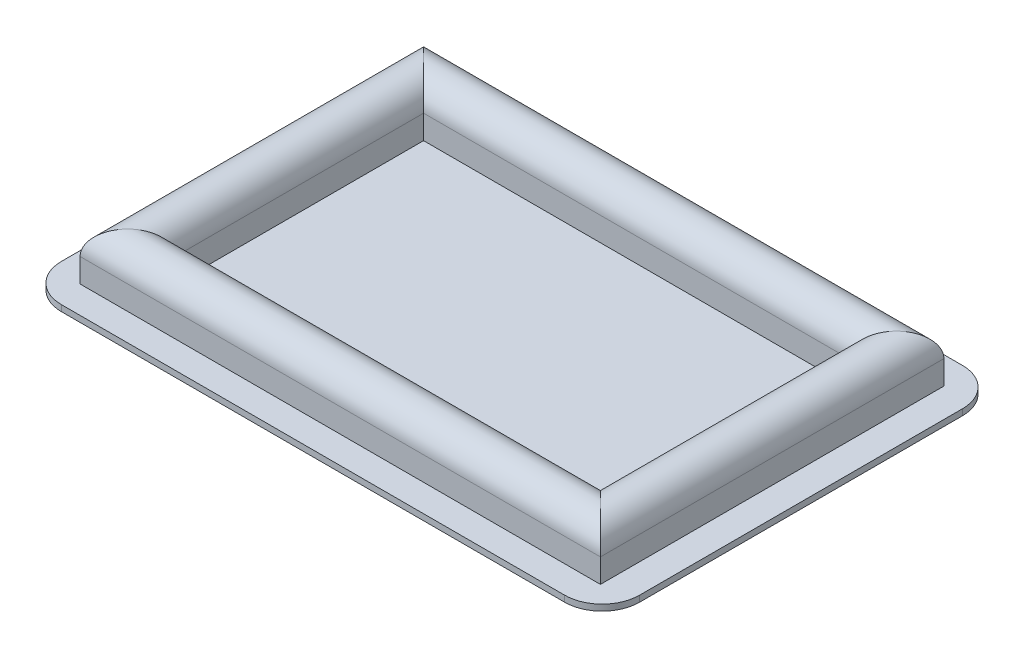
ISO-10303-21;
HEADER;
FILE_DESCRIPTION(('STEP AP214'),'2;1');
FILE_NAME('part.step','',(''),(''),'','','');
FILE_SCHEMA(('AUTOMOTIVE_DESIGN { 1 0 10303 214 1 1 1 1 }'));
ENDSEC;
DATA;
#1=APPLICATION_CONTEXT('core data for automotive mechanical design processes');
#2=APPLICATION_PROTOCOL_DEFINITION('international standard','automotive_design',2000,#1);
#3=PRODUCT_CONTEXT('',#1,'mechanical');
#4=PRODUCT('Part','Part','',(#3));
#5=PRODUCT_RELATED_PRODUCT_CATEGORY('part','',(#4));
#6=PRODUCT_DEFINITION_FORMATION('','',#4);
#7=PRODUCT_DEFINITION_CONTEXT('part definition',#1,'design');
#8=PRODUCT_DEFINITION('design','',#6,#7);
#9=PRODUCT_DEFINITION_SHAPE('','',#8);
#10=(LENGTH_UNIT() NAMED_UNIT(*) SI_UNIT(.MILLI.,.METRE.));
#11=(NAMED_UNIT(*) PLANE_ANGLE_UNIT() SI_UNIT($,.RADIAN.));
#12=(NAMED_UNIT(*) SI_UNIT($,.STERADIAN.) SOLID_ANGLE_UNIT());
#13=UNCERTAINTY_MEASURE_WITH_UNIT(LENGTH_MEASURE(1.E-05),#10,'distance_accuracy_value','');
#14=(GEOMETRIC_REPRESENTATION_CONTEXT(3) GLOBAL_UNCERTAINTY_ASSIGNED_CONTEXT((#13)) GLOBAL_UNIT_ASSIGNED_CONTEXT((#10,
#11,#12)) REPRESENTATION_CONTEXT('',''));
#15=CARTESIAN_POINT('',(0.,0.,0.));
#16=DIRECTION('',(0.,0.,1.));
#17=DIRECTION('',(1.,0.,0.));
#18=AXIS2_PLACEMENT_3D('',#15,#16,#17);
#19=CARTESIAN_POINT('',(-37.,0.9,23.75));
#20=DIRECTION('',(0.,-1.,0.));
#21=DIRECTION('',(0.,0.,-1.));
#22=AXIS2_PLACEMENT_3D('',#19,#20,#21);
#23=PLANE('',#22);
#24=CARTESIAN_POINT('',(-37.,0.9,23.75));
#25=DIRECTION('',(0.,1.,0.));
#26=DIRECTION('',(0.,0.,-1.));
#27=AXIS2_PLACEMENT_3D('',#24,#25,#26);
#28=CIRCLE('',#27,5.5);
#29=CARTESIAN_POINT('',(-42.5,0.9,23.75));
#30=VERTEX_POINT('',#29);
#31=CARTESIAN_POINT('',(-37.,0.9,29.25));
#32=VERTEX_POINT('',#31);
#33=EDGE_CURVE('E226',#30,#32,#28,.T.);
#34=ORIENTED_EDGE('',*,*,#33,.T.);
#35=DIRECTION('',(1.,0.,0.));
#36=VECTOR('',#35,1.);
#37=CARTESIAN_POINT('',(37.,0.9,29.25));
#38=LINE('',#37,#36);
#39=CARTESIAN_POINT('',(37.,0.9,29.25));
#40=VERTEX_POINT('',#39);
#41=EDGE_CURVE('E229',#32,#40,#38,.T.);
#42=ORIENTED_EDGE('',*,*,#41,.T.);
#43=CARTESIAN_POINT('',(37.,0.9,23.75));
#44=DIRECTION('',(0.,1.,0.));
#45=DIRECTION('',(0.,0.,1.));
#46=AXIS2_PLACEMENT_3D('',#43,#44,#45);
#47=CIRCLE('',#46,5.5);
#48=CARTESIAN_POINT('',(42.5,0.9,23.75));
#49=VERTEX_POINT('',#48);
#50=EDGE_CURVE('E232',#40,#49,#47,.T.);
#51=ORIENTED_EDGE('',*,*,#50,.T.);
#52=DIRECTION('',(0.,0.,-1.));
#53=VECTOR('',#52,1.);
#54=CARTESIAN_POINT('',(42.5,0.9,23.75));
#55=LINE('',#54,#53);
#56=CARTESIAN_POINT('',(42.5,0.9,-23.75));
#57=VERTEX_POINT('',#56);
#58=EDGE_CURVE('E234',#49,#57,#55,.T.);
#59=ORIENTED_EDGE('',*,*,#58,.T.);
#60=CARTESIAN_POINT('',(37.,0.9,-23.75));
#61=DIRECTION('',(0.,1.,0.));
#62=DIRECTION('',(0.,0.,1.));
#63=AXIS2_PLACEMENT_3D('',#60,#61,#62);
#64=CIRCLE('',#63,5.5);
#65=CARTESIAN_POINT('',(37.,0.9,-29.25));
#66=VERTEX_POINT('',#65);
#67=EDGE_CURVE('E236',#57,#66,#64,.T.);
#68=ORIENTED_EDGE('',*,*,#67,.T.);
#69=DIRECTION('',(-1.,0.,0.));
#70=VECTOR('',#69,1.);
#71=CARTESIAN_POINT('',(37.,0.9,-29.25));
#72=LINE('',#71,#70);
#73=CARTESIAN_POINT('',(-37.,0.9,-29.25));
#74=VERTEX_POINT('',#73);
#75=EDGE_CURVE('E238',#66,#74,#72,.T.);
#76=ORIENTED_EDGE('',*,*,#75,.T.);
#77=CARTESIAN_POINT('',(-37.,0.9,-23.75));
#78=DIRECTION('',(0.,1.,0.));
#79=DIRECTION('',(0.,0.,1.));
#80=AXIS2_PLACEMENT_3D('',#77,#78,#79);
#81=CIRCLE('',#80,5.5);
#82=CARTESIAN_POINT('',(-42.5,0.9,-23.75));
#83=VERTEX_POINT('',#82);
#84=EDGE_CURVE('E240',#74,#83,#81,.T.);
#85=ORIENTED_EDGE('',*,*,#84,.T.);
#86=DIRECTION('',(0.,0.,1.));
#87=VECTOR('',#86,1.);
#88=CARTESIAN_POINT('',(-42.5,0.9,23.75));
#89=LINE('',#88,#87);
#90=EDGE_CURVE('E242',#83,#30,#89,.T.);
#91=ORIENTED_EDGE('',*,*,#90,.T.);
#92=EDGE_LOOP('',(#34,#42,#51,#59,#68,#76,#85,#91));
#93=FACE_BOUND('',#92,.T.);
#94=DIRECTION('',(-1.,0.,0.));
#95=VECTOR('',#94,1.);
#96=CARTESIAN_POINT('',(38.25,0.9,25.25));
#97=LINE('',#96,#95);
#98=CARTESIAN_POINT('',(38.25,0.9,25.25));
#99=VERTEX_POINT('',#98);
#100=CARTESIAN_POINT('',(-38.25,0.9,25.25));
#101=VERTEX_POINT('',#100);
#102=EDGE_CURVE('E210',#99,#101,#97,.T.);
#103=ORIENTED_EDGE('',*,*,#102,.T.);
#104=DIRECTION('',(0.,0.,1.));
#105=VECTOR('',#104,1.);
#106=CARTESIAN_POINT('',(-38.25,0.9,-41.5489898732233));
#107=LINE('',#106,#105);
#108=CARTESIAN_POINT('',(-38.25,0.9,-25.25));
#109=VERTEX_POINT('',#108);
#110=EDGE_CURVE('E172',#109,#101,#107,.T.);
#111=ORIENTED_EDGE('',*,*,#110,.F.);
#112=DIRECTION('',(1.,0.,0.));
#113=VECTOR('',#112,1.);
#114=CARTESIAN_POINT('',(-38.25,0.9,-25.25));
#115=LINE('',#114,#113);
#116=CARTESIAN_POINT('',(38.25,0.9,-25.25));
#117=VERTEX_POINT('',#116);
#118=EDGE_CURVE('E177',#109,#117,#115,.T.);
#119=ORIENTED_EDGE('',*,*,#118,.T.);
#120=DIRECTION('',(0.,0.,1.));
#121=VECTOR('',#120,1.);
#122=CARTESIAN_POINT('',(38.25,0.9,-25.25));
#123=LINE('',#122,#121);
#124=EDGE_CURVE('E192',#117,#99,#123,.T.);
#125=ORIENTED_EDGE('',*,*,#124,.T.);
#126=EDGE_LOOP('',(#103,#111,#119,#125));
#127=FACE_BOUND('',#126,.T.);
#128=ADVANCED_FACE('F37',(#93,#127),#23,.F.);
#129=CARTESIAN_POINT('',(-37.,0.9,23.75));
#130=DIRECTION('',(0.,-1.,0.));
#131=DIRECTION('',(0.,0.,-1.));
#132=AXIS2_PLACEMENT_3D('',#129,#130,#131);
#133=CYLINDRICAL_SURFACE('',#132,5.5);
#134=CARTESIAN_POINT('',(-37.,0.,23.75));
#135=DIRECTION('',(0.,1.,0.));
#136=DIRECTION('',(0.,0.,-1.));
#137=AXIS2_PLACEMENT_3D('',#134,#135,#136);
#138=CIRCLE('',#137,5.5);
#139=CARTESIAN_POINT('',(-42.5,0.,23.75));
#140=VERTEX_POINT('',#139);
#141=CARTESIAN_POINT('',(-37.,0.,29.25));
#142=VERTEX_POINT('',#141);
#143=EDGE_CURVE('E245',#140,#142,#138,.T.);
#144=ORIENTED_EDGE('',*,*,#143,.T.);
#145=DIRECTION('',(0.,-1.,0.));
#146=VECTOR('',#145,1.);
#147=CARTESIAN_POINT('',(-37.,0.9,29.25));
#148=LINE('',#147,#146);
#149=EDGE_CURVE('E12',#32,#142,#148,.T.);
#150=ORIENTED_EDGE('',*,*,#149,.F.);
#151=ORIENTED_EDGE('',*,*,#33,.F.);
#152=DIRECTION('',(0.,-1.,0.));
#153=VECTOR('',#152,1.);
#154=CARTESIAN_POINT('',(-42.5,0.9,23.75));
#155=LINE('',#154,#153);
#156=EDGE_CURVE('E244',#30,#140,#155,.T.);
#157=ORIENTED_EDGE('',*,*,#156,.T.);
#158=EDGE_LOOP('',(#144,#150,#151,#157));
#159=FACE_BOUND('',#158,.T.);
#160=ADVANCED_FACE('F39',(#159),#133,.T.);
#161=CARTESIAN_POINT('',(37.,0.9,29.25));
#162=DIRECTION('',(0.,0.,-1.));
#163=DIRECTION('',(-1.,0.,0.));
#164=AXIS2_PLACEMENT_3D('',#161,#162,#163);
#165=PLANE('',#164);
#166=DIRECTION('',(1.,0.,0.));
#167=VECTOR('',#166,1.);
#168=CARTESIAN_POINT('',(37.,0.,29.25));
#169=LINE('',#168,#167);
#170=CARTESIAN_POINT('',(37.,0.,29.25));
#171=VERTEX_POINT('',#170);
#172=EDGE_CURVE('E248',#142,#171,#169,.T.);
#173=ORIENTED_EDGE('',*,*,#172,.T.);
#174=DIRECTION('',(0.,-1.,0.));
#175=VECTOR('',#174,1.);
#176=CARTESIAN_POINT('',(37.,0.9,29.25));
#177=LINE('',#176,#175);
#178=EDGE_CURVE('E45',#40,#171,#177,.T.);
#179=ORIENTED_EDGE('',*,*,#178,.F.);
#180=ORIENTED_EDGE('',*,*,#41,.F.);
#181=ORIENTED_EDGE('',*,*,#149,.T.);
#182=EDGE_LOOP('',(#173,#179,#180,#181));
#183=FACE_BOUND('',#182,.T.);
#184=ADVANCED_FACE('F305',(#183),#165,.F.);
#185=CARTESIAN_POINT('',(37.,0.9,23.75));
#186=DIRECTION('',(0.,-1.,0.));
#187=DIRECTION('',(0.,0.,-1.));
#188=AXIS2_PLACEMENT_3D('',#185,#186,#187);
#189=CYLINDRICAL_SURFACE('',#188,5.5);
#190=CARTESIAN_POINT('',(37.,0.,23.75));
#191=DIRECTION('',(0.,1.,0.));
#192=DIRECTION('',(0.,0.,1.));
#193=AXIS2_PLACEMENT_3D('',#190,#191,#192);
#194=CIRCLE('',#193,5.5);
#195=CARTESIAN_POINT('',(42.5,0.,23.75));
#196=VERTEX_POINT('',#195);
#197=EDGE_CURVE('E250',#171,#196,#194,.T.);
#198=ORIENTED_EDGE('',*,*,#197,.T.);
#199=DIRECTION('',(0.,-1.,0.));
#200=VECTOR('',#199,1.);
#201=CARTESIAN_POINT('',(42.5,0.9,23.75));
#202=LINE('',#201,#200);
#203=EDGE_CURVE('E275',#49,#196,#202,.T.);
#204=ORIENTED_EDGE('',*,*,#203,.F.);
#205=ORIENTED_EDGE('',*,*,#50,.F.);
#206=ORIENTED_EDGE('',*,*,#178,.T.);
#207=EDGE_LOOP('',(#198,#204,#205,#206));
#208=FACE_BOUND('',#207,.T.);
#209=ADVANCED_FACE('F282',(#208),#189,.T.);
#210=CARTESIAN_POINT('',(42.5,0.9,23.75));
#211=DIRECTION('',(-1.,0.,0.));
#212=DIRECTION('',(0.,0.,1.));
#213=AXIS2_PLACEMENT_3D('',#210,#211,#212);
#214=PLANE('',#213);
#215=DIRECTION('',(0.,0.,-1.));
#216=VECTOR('',#215,1.);
#217=CARTESIAN_POINT('',(42.5,0.,23.75));
#218=LINE('',#217,#216);
#219=CARTESIAN_POINT('',(42.5,0.,-23.75));
#220=VERTEX_POINT('',#219);
#221=EDGE_CURVE('E252',#196,#220,#218,.T.);
#222=ORIENTED_EDGE('',*,*,#221,.T.);
#223=DIRECTION('',(0.,-1.,0.));
#224=VECTOR('',#223,1.);
#225=CARTESIAN_POINT('',(42.5,0.9,-23.75));
#226=LINE('',#225,#224);
#227=EDGE_CURVE('E272',#57,#220,#226,.T.);
#228=ORIENTED_EDGE('',*,*,#227,.F.);
#229=ORIENTED_EDGE('',*,*,#58,.F.);
#230=ORIENTED_EDGE('',*,*,#203,.T.);
#231=EDGE_LOOP('',(#222,#228,#229,#230));
#232=FACE_BOUND('',#231,.T.);
#233=ADVANCED_FACE('F293',(#232),#214,.F.);
#234=CARTESIAN_POINT('',(37.,0.9,-23.75));
#235=DIRECTION('',(0.,-1.,0.));
#236=DIRECTION('',(0.,0.,-1.));
#237=AXIS2_PLACEMENT_3D('',#234,#235,#236);
#238=CYLINDRICAL_SURFACE('',#237,5.5);
#239=CARTESIAN_POINT('',(37.,0.,-23.75));
#240=DIRECTION('',(0.,1.,0.));
#241=DIRECTION('',(0.,0.,1.));
#242=AXIS2_PLACEMENT_3D('',#239,#240,#241);
#243=CIRCLE('',#242,5.5);
#244=CARTESIAN_POINT('',(37.,0.,-29.25));
#245=VERTEX_POINT('',#244);
#246=EDGE_CURVE('E254',#220,#245,#243,.T.);
#247=ORIENTED_EDGE('',*,*,#246,.T.);
#248=DIRECTION('',(0.,-1.,0.));
#249=VECTOR('',#248,1.);
#250=CARTESIAN_POINT('',(37.,0.9,-29.25));
#251=LINE('',#250,#249);
#252=EDGE_CURVE('E269',#66,#245,#251,.T.);
#253=ORIENTED_EDGE('',*,*,#252,.F.);
#254=ORIENTED_EDGE('',*,*,#67,.F.);
#255=ORIENTED_EDGE('',*,*,#227,.T.);
#256=EDGE_LOOP('',(#247,#253,#254,#255));
#257=FACE_BOUND('',#256,.T.);
#258=ADVANCED_FACE('F297',(#257),#238,.T.);
#259=CARTESIAN_POINT('',(37.,0.9,-29.25));
#260=DIRECTION('',(0.,0.,1.));
#261=DIRECTION('',(1.,0.,0.));
#262=AXIS2_PLACEMENT_3D('',#259,#260,#261);
#263=PLANE('',#262);
#264=DIRECTION('',(-1.,0.,0.));
#265=VECTOR('',#264,1.);
#266=CARTESIAN_POINT('',(37.,0.,-29.25));
#267=LINE('',#266,#265);
#268=CARTESIAN_POINT('',(-37.,0.,-29.25));
#269=VERTEX_POINT('',#268);
#270=EDGE_CURVE('E256',#245,#269,#267,.T.);
#271=ORIENTED_EDGE('',*,*,#270,.T.);
#272=DIRECTION('',(0.,-1.,0.));
#273=VECTOR('',#272,1.);
#274=CARTESIAN_POINT('',(-37.,0.9,-29.25));
#275=LINE('',#274,#273);
#276=EDGE_CURVE('E266',#74,#269,#275,.T.);
#277=ORIENTED_EDGE('',*,*,#276,.F.);
#278=ORIENTED_EDGE('',*,*,#75,.F.);
#279=ORIENTED_EDGE('',*,*,#252,.T.);
#280=EDGE_LOOP('',(#271,#277,#278,#279));
#281=FACE_BOUND('',#280,.T.);
#282=ADVANCED_FACE('F318',(#281),#263,.F.);
#283=CARTESIAN_POINT('',(-37.,0.9,-23.75));
#284=DIRECTION('',(0.,-1.,0.));
#285=DIRECTION('',(0.,0.,-1.));
#286=AXIS2_PLACEMENT_3D('',#283,#284,#285);
#287=CYLINDRICAL_SURFACE('',#286,5.5);
#288=CARTESIAN_POINT('',(-37.,0.,-23.75));
#289=DIRECTION('',(0.,1.,0.));
#290=DIRECTION('',(0.,0.,1.));
#291=AXIS2_PLACEMENT_3D('',#288,#289,#290);
#292=CIRCLE('',#291,5.5);
#293=CARTESIAN_POINT('',(-42.5,0.,-23.75));
#294=VERTEX_POINT('',#293);
#295=EDGE_CURVE('E258',#269,#294,#292,.T.);
#296=ORIENTED_EDGE('',*,*,#295,.T.);
#297=DIRECTION('',(0.,-1.,0.));
#298=VECTOR('',#297,1.);
#299=CARTESIAN_POINT('',(-42.5,0.9,-23.75));
#300=LINE('',#299,#298);
#301=EDGE_CURVE('E263',#83,#294,#300,.T.);
#302=ORIENTED_EDGE('',*,*,#301,.F.);
#303=ORIENTED_EDGE('',*,*,#84,.F.);
#304=ORIENTED_EDGE('',*,*,#276,.T.);
#305=EDGE_LOOP('',(#296,#302,#303,#304));
#306=FACE_BOUND('',#305,.T.);
#307=ADVANCED_FACE('F316',(#306),#287,.T.);
#308=CARTESIAN_POINT('',(-42.5,0.9,23.75));
#309=DIRECTION('',(1.,0.,0.));
#310=DIRECTION('',(0.,0.,-1.));
#311=AXIS2_PLACEMENT_3D('',#308,#309,#310);
#312=PLANE('',#311);
#313=DIRECTION('',(0.,0.,1.));
#314=VECTOR('',#313,1.);
#315=CARTESIAN_POINT('',(-42.5,0.,23.75));
#316=LINE('',#315,#314);
#317=EDGE_CURVE('E230',#294,#140,#316,.T.);
#318=ORIENTED_EDGE('',*,*,#317,.T.);
#319=ORIENTED_EDGE('',*,*,#156,.F.);
#320=ORIENTED_EDGE('',*,*,#90,.F.);
#321=ORIENTED_EDGE('',*,*,#301,.T.);
#322=EDGE_LOOP('',(#318,#319,#320,#321));
#323=FACE_BOUND('',#322,.T.);
#324=ADVANCED_FACE('F311',(#323),#312,.F.);
#325=CARTESIAN_POINT('',(-37.,0.,23.75));
#326=DIRECTION('',(0.,-1.,0.));
#327=DIRECTION('',(0.,0.,-1.));
#328=AXIS2_PLACEMENT_3D('',#325,#326,#327);
#329=PLANE('',#328);
#330=ORIENTED_EDGE('',*,*,#143,.F.);
#331=ORIENTED_EDGE('',*,*,#317,.F.);
#332=ORIENTED_EDGE('',*,*,#295,.F.);
#333=ORIENTED_EDGE('',*,*,#270,.F.);
#334=ORIENTED_EDGE('',*,*,#246,.F.);
#335=ORIENTED_EDGE('',*,*,#221,.F.);
#336=ORIENTED_EDGE('',*,*,#197,.F.);
#337=ORIENTED_EDGE('',*,*,#172,.F.);
#338=EDGE_LOOP('',(#330,#331,#332,#333,#334,#335,#336,#337));
#339=FACE_BOUND('',#338,.T.);
#340=ADVANCED_FACE('F288',(#339),#329,.T.);
#341=CARTESIAN_POINT('',(31.25,0.900000000000075,18.25));
#342=DIRECTION('',(0.,0.,1.));
#343=DIRECTION('',(0.,-1.,0.));
#344=AXIS2_PLACEMENT_3D('',#341,#342,#343);
#345=PLANE('',#344);
#346=DIRECTION('',(0.,-1.,0.));
#347=VECTOR('',#346,1.);
#348=CARTESIAN_POINT('',(-31.25,0.900000000000137,18.25));
#349=LINE('',#348,#347);
#350=CARTESIAN_POINT('',(-31.25,4.4,18.25));
#351=VERTEX_POINT('',#350);
#352=CARTESIAN_POINT('',(-31.25,0.9,18.25));
#353=VERTEX_POINT('',#352);
#354=EDGE_CURVE('E169',#351,#353,#349,.T.);
#355=ORIENTED_EDGE('',*,*,#354,.F.);
#356=DIRECTION('',(-1.,0.,0.));
#357=VECTOR('',#356,1.);
#358=CARTESIAN_POINT('',(31.25,4.4,18.25));
#359=LINE('',#358,#357);
#360=CARTESIAN_POINT('',(31.25,4.4,18.25));
#361=VERTEX_POINT('',#360);
#362=EDGE_CURVE('E203',#361,#351,#359,.T.);
#363=ORIENTED_EDGE('',*,*,#362,.F.);
#364=DIRECTION('',(0.,1.,0.));
#365=VECTOR('',#364,1.);
#366=CARTESIAN_POINT('',(31.25,0.900000000000075,18.25));
#367=LINE('',#366,#365);
#368=CARTESIAN_POINT('',(31.25,0.9,18.25));
#369=VERTEX_POINT('',#368);
#370=EDGE_CURVE('E199',#369,#361,#367,.T.);
#371=ORIENTED_EDGE('',*,*,#370,.F.);
#372=DIRECTION('',(-1.,0.,0.));
#373=VECTOR('',#372,1.);
#374=CARTESIAN_POINT('',(31.25,0.9,18.25));
#375=LINE('',#374,#373);
#376=EDGE_CURVE('E52',#369,#353,#375,.T.);
#377=ORIENTED_EDGE('',*,*,#376,.T.);
#378=EDGE_LOOP('',(#355,#363,#371,#377));
#379=FACE_BOUND('',#378,.T.);
#380=ADVANCED_FACE('F371',(#379),#345,.F.);
#381=CARTESIAN_POINT('',(34.75,4.4,21.75));
#382=DIRECTION('',(-1.,0.,0.));
#383=DIRECTION('',(0.,0.,1.));
#384=AXIS2_PLACEMENT_3D('',#381,#382,#383);
#385=CYLINDRICAL_SURFACE('',#384,3.5);
#386=CARTESIAN_POINT('',(-34.75,4.4,21.75));
#387=DIRECTION('',(-0.707106781186548,0.,-0.707106781186547));
#388=DIRECTION('',(-0.707106781186547,0.,0.707106781186548));
#389=AXIS2_PLACEMENT_3D('',#386,#387,#388);
#390=ELLIPSE('',#389,4.94974746830584,3.5);
#391=CARTESIAN_POINT('',(-38.25,4.4,25.25));
#392=VERTEX_POINT('',#391);
#393=EDGE_CURVE('E386',#392,#351,#390,.T.);
#394=ORIENTED_EDGE('',*,*,#393,.F.);
#395=DIRECTION('',(-1.,0.,0.));
#396=VECTOR('',#395,1.);
#397=CARTESIAN_POINT('',(38.25,4.4,25.25));
#398=LINE('',#397,#396);
#399=CARTESIAN_POINT('',(38.25,4.4,25.25));
#400=VERTEX_POINT('',#399);
#401=EDGE_CURVE('E206',#400,#392,#398,.T.);
#402=ORIENTED_EDGE('',*,*,#401,.F.);
#403=CARTESIAN_POINT('',(34.75,4.4,21.75));
#404=DIRECTION('',(-0.707106781186548,0.,0.707106781186548));
#405=DIRECTION('',(0.707106781186548,0.,0.707106781186548));
#406=AXIS2_PLACEMENT_3D('',#403,#404,#405);
#407=ELLIPSE('',#406,4.94974746830584,3.5);
#408=EDGE_CURVE('E202',#361,#400,#407,.F.);
#409=ORIENTED_EDGE('',*,*,#408,.F.);
#410=ORIENTED_EDGE('',*,*,#362,.T.);
#411=EDGE_LOOP('',(#394,#402,#409,#410));
#412=FACE_BOUND('',#411,.T.);
#413=ADVANCED_FACE('F374',(#412),#385,.T.);
#414=CARTESIAN_POINT('',(38.25,0.9,25.25));
#415=DIRECTION('',(0.,0.,-1.));
#416=DIRECTION('',(-1.,0.,0.));
#417=AXIS2_PLACEMENT_3D('',#414,#415,#416);
#418=PLANE('',#417);
#419=DIRECTION('',(0.,1.,0.));
#420=VECTOR('',#419,1.);
#421=CARTESIAN_POINT('',(-38.25,0.9,25.25));
#422=LINE('',#421,#420);
#423=EDGE_CURVE('E214',#101,#392,#422,.T.);
#424=ORIENTED_EDGE('',*,*,#423,.F.);
#425=ORIENTED_EDGE('',*,*,#102,.F.);
#426=DIRECTION('',(0.,-1.,0.));
#427=VECTOR('',#426,1.);
#428=CARTESIAN_POINT('',(38.25,0.9,25.25));
#429=LINE('',#428,#427);
#430=EDGE_CURVE('E207',#400,#99,#429,.T.);
#431=ORIENTED_EDGE('',*,*,#430,.F.);
#432=ORIENTED_EDGE('',*,*,#401,.T.);
#433=EDGE_LOOP('',(#424,#425,#431,#432));
#434=FACE_BOUND('',#433,.T.);
#435=ADVANCED_FACE('F363',(#434),#418,.F.);
#436=CARTESIAN_POINT('',(34.75,4.4,-21.75));
#437=DIRECTION('',(0.,0.,1.));
#438=DIRECTION('',(1.,0.,0.));
#439=AXIS2_PLACEMENT_3D('',#436,#437,#438);
#440=CYLINDRICAL_SURFACE('',#439,3.5);
#441=DIRECTION('',(0.,0.,1.));
#442=VECTOR('',#441,1.);
#443=CARTESIAN_POINT('',(31.25,4.4,-18.25));
#444=LINE('',#443,#442);
#445=CARTESIAN_POINT('',(31.25,4.4,-18.25));
#446=VERTEX_POINT('',#445);
#447=EDGE_CURVE('E196',#446,#361,#444,.T.);
#448=ORIENTED_EDGE('',*,*,#447,.T.);
#449=ORIENTED_EDGE('',*,*,#408,.T.);
#450=DIRECTION('',(0.,0.,1.));
#451=VECTOR('',#450,1.);
#452=CARTESIAN_POINT('',(38.25,4.4,-25.25));
#453=LINE('',#452,#451);
#454=CARTESIAN_POINT('',(38.25,4.4,-25.25));
#455=VERTEX_POINT('',#454);
#456=EDGE_CURVE('E188',#455,#400,#453,.T.);
#457=ORIENTED_EDGE('',*,*,#456,.F.);
#458=CARTESIAN_POINT('',(34.75,4.4,-21.75));
#459=DIRECTION('',(0.707106781186548,0.,0.707106781186547));
#460=DIRECTION('',(0.707106781186547,0.,-0.707106781186548));
#461=AXIS2_PLACEMENT_3D('',#458,#459,#460);
#462=ELLIPSE('',#461,4.94974746830584,3.5);
#463=EDGE_CURVE('E189',#455,#446,#462,.T.);
#464=ORIENTED_EDGE('',*,*,#463,.T.);
#465=EDGE_LOOP('',(#448,#449,#457,#464));
#466=FACE_BOUND('',#465,.T.);
#467=ADVANCED_FACE('F359',(#466),#440,.T.);
#468=CARTESIAN_POINT('',(38.25,0.9,-25.25));
#469=DIRECTION('',(1.,0.,0.));
#470=DIRECTION('',(0.,0.,-1.));
#471=AXIS2_PLACEMENT_3D('',#468,#469,#470);
#472=PLANE('',#471);
#473=ORIENTED_EDGE('',*,*,#456,.T.);
#474=ORIENTED_EDGE('',*,*,#430,.T.);
#475=ORIENTED_EDGE('',*,*,#124,.F.);
#476=DIRECTION('',(0.,1.,0.));
#477=VECTOR('',#476,1.);
#478=CARTESIAN_POINT('',(38.25,0.9,-25.25));
#479=LINE('',#478,#477);
#480=EDGE_CURVE('E179',#117,#455,#479,.T.);
#481=ORIENTED_EDGE('',*,*,#480,.T.);
#482=EDGE_LOOP('',(#473,#474,#475,#481));
#483=FACE_BOUND('',#482,.T.);
#484=ADVANCED_FACE('F362',(#483),#472,.T.);
#485=CARTESIAN_POINT('',(31.25,0.900000000000039,-18.25));
#486=DIRECTION('',(-1.,0.,0.));
#487=DIRECTION('',(0.,-1.,0.));
#488=AXIS2_PLACEMENT_3D('',#485,#486,#487);
#489=PLANE('',#488);
#490=DIRECTION('',(0.,0.,1.));
#491=VECTOR('',#490,1.);
#492=CARTESIAN_POINT('',(31.25,0.9,-18.25));
#493=LINE('',#492,#491);
#494=CARTESIAN_POINT('',(31.25,0.9,-18.25));
#495=VERTEX_POINT('',#494);
#496=EDGE_CURVE('E176',#495,#369,#493,.T.);
#497=ORIENTED_EDGE('',*,*,#496,.T.);
#498=ORIENTED_EDGE('',*,*,#370,.T.);
#499=ORIENTED_EDGE('',*,*,#447,.F.);
#500=DIRECTION('',(0.,-1.,0.));
#501=VECTOR('',#500,1.);
#502=CARTESIAN_POINT('',(31.25,0.900000000000039,-18.25));
#503=LINE('',#502,#501);
#504=EDGE_CURVE('E186',#446,#495,#503,.T.);
#505=ORIENTED_EDGE('',*,*,#504,.T.);
#506=EDGE_LOOP('',(#497,#498,#499,#505));
#507=FACE_BOUND('',#506,.T.);
#508=ADVANCED_FACE('F352',(#507),#489,.T.);
#509=CARTESIAN_POINT('',(-34.75,4.4,-21.75));
#510=DIRECTION('',(1.,0.,0.));
#511=DIRECTION('',(0.,0.,-1.));
#512=AXIS2_PLACEMENT_3D('',#509,#510,#511);
#513=CYLINDRICAL_SURFACE('',#512,3.5);
#514=ORIENTED_EDGE('',*,*,#463,.F.);
#515=DIRECTION('',(1.,0.,0.));
#516=VECTOR('',#515,1.);
#517=CARTESIAN_POINT('',(-38.25,4.4,-25.25));
#518=LINE('',#517,#516);
#519=CARTESIAN_POINT('',(-38.25,4.4,-25.25));
#520=VERTEX_POINT('',#519);
#521=EDGE_CURVE('E182',#520,#455,#518,.T.);
#522=ORIENTED_EDGE('',*,*,#521,.F.);
#523=CARTESIAN_POINT('',(-34.75,4.4,-21.75));
#524=DIRECTION('',(0.707106781186548,0.,-0.707106781186548));
#525=DIRECTION('',(0.707106781186548,0.,0.707106781186548));
#526=AXIS2_PLACEMENT_3D('',#523,#524,#525);
#527=ELLIPSE('',#526,4.94974746830584,3.5);
#528=CARTESIAN_POINT('',(-31.25,4.4,-18.25));
#529=VERTEX_POINT('',#528);
#530=EDGE_CURVE('E163',#529,#520,#527,.F.);
#531=ORIENTED_EDGE('',*,*,#530,.F.);
#532=DIRECTION('',(1.,0.,0.));
#533=VECTOR('',#532,1.);
#534=CARTESIAN_POINT('',(-31.25,4.4,-18.25));
#535=LINE('',#534,#533);
#536=EDGE_CURVE('E160',#529,#446,#535,.T.);
#537=ORIENTED_EDGE('',*,*,#536,.T.);
#538=EDGE_LOOP('',(#514,#522,#531,#537));
#539=FACE_BOUND('',#538,.T.);
#540=ADVANCED_FACE('F348',(#539),#513,.T.);
#541=CARTESIAN_POINT('',(-38.25,0.9,-25.25));
#542=DIRECTION('',(0.,0.,1.));
#543=DIRECTION('',(1.,0.,0.));
#544=AXIS2_PLACEMENT_3D('',#541,#542,#543);
#545=PLANE('',#544);
#546=ORIENTED_EDGE('',*,*,#480,.F.);
#547=ORIENTED_EDGE('',*,*,#118,.F.);
#548=DIRECTION('',(0.,-1.,0.));
#549=VECTOR('',#548,1.);
#550=CARTESIAN_POINT('',(-38.25,0.9,-25.25));
#551=LINE('',#550,#549);
#552=EDGE_CURVE('E60',#520,#109,#551,.T.);
#553=ORIENTED_EDGE('',*,*,#552,.F.);
#554=ORIENTED_EDGE('',*,*,#521,.T.);
#555=EDGE_LOOP('',(#546,#547,#553,#554));
#556=FACE_BOUND('',#555,.T.);
#557=ADVANCED_FACE('F351',(#556),#545,.F.);
#558=CARTESIAN_POINT('',(-31.25,0.899999999999977,-18.25));
#559=DIRECTION('',(0.,0.,-1.));
#560=DIRECTION('',(0.,1.,0.));
#561=AXIS2_PLACEMENT_3D('',#558,#559,#560);
#562=PLANE('',#561);
#563=ORIENTED_EDGE('',*,*,#504,.F.);
#564=ORIENTED_EDGE('',*,*,#536,.F.);
#565=DIRECTION('',(0.,1.,0.));
#566=VECTOR('',#565,1.);
#567=CARTESIAN_POINT('',(-31.25,0.899999999999977,-18.25));
#568=LINE('',#567,#566);
#569=CARTESIAN_POINT('',(-31.25,0.9,-18.25));
#570=VERTEX_POINT('',#569);
#571=EDGE_CURVE('E152',#570,#529,#568,.T.);
#572=ORIENTED_EDGE('',*,*,#571,.F.);
#573=DIRECTION('',(1.,0.,0.));
#574=VECTOR('',#573,1.);
#575=CARTESIAN_POINT('',(-31.25,0.9,-18.25));
#576=LINE('',#575,#574);
#577=EDGE_CURVE('E157',#570,#495,#576,.T.);
#578=ORIENTED_EDGE('',*,*,#577,.T.);
#579=EDGE_LOOP('',(#563,#564,#572,#578));
#580=FACE_BOUND('',#579,.T.);
#581=ADVANCED_FACE('F155',(#580),#562,.F.);
#582=CARTESIAN_POINT('',(-31.25,0.9,-41.5489898732233));
#583=DIRECTION('',(1.,0.,0.));
#584=DIRECTION('',(0.,1.,0.));
#585=AXIS2_PLACEMENT_3D('',#582,#583,#584);
#586=PLANE('',#585);
#587=DIRECTION('',(0.,0.,1.));
#588=VECTOR('',#587,1.);
#589=CARTESIAN_POINT('',(-31.25,0.9,-41.5489898732233));
#590=LINE('',#589,#588);
#591=EDGE_CURVE('E167',#570,#353,#590,.T.);
#592=ORIENTED_EDGE('',*,*,#591,.F.);
#593=ORIENTED_EDGE('',*,*,#571,.T.);
#594=DIRECTION('',(0.,0.,1.));
#595=VECTOR('',#594,1.);
#596=CARTESIAN_POINT('',(-31.25,4.4,-41.5489898732233));
#597=LINE('',#596,#595);
#598=EDGE_CURVE('E171',#529,#351,#597,.T.);
#599=ORIENTED_EDGE('',*,*,#598,.T.);
#600=ORIENTED_EDGE('',*,*,#354,.T.);
#601=EDGE_LOOP('',(#592,#593,#599,#600));
#602=FACE_BOUND('',#601,.T.);
#603=ADVANCED_FACE('F168',(#602),#586,.T.);
#604=CARTESIAN_POINT('',(-34.75,4.4,-41.5489898732233));
#605=DIRECTION('',(0.,0.,1.));
#606=DIRECTION('',(1.,0.,0.));
#607=AXIS2_PLACEMENT_3D('',#604,#605,#606);
#608=CYLINDRICAL_SURFACE('',#607,3.5);
#609=ORIENTED_EDGE('',*,*,#598,.F.);
#610=ORIENTED_EDGE('',*,*,#530,.T.);
#611=DIRECTION('',(0.,0.,1.));
#612=VECTOR('',#611,1.);
#613=CARTESIAN_POINT('',(-38.25,4.4,-41.5489898732233));
#614=LINE('',#613,#612);
#615=EDGE_CURVE('E164',#520,#392,#614,.T.);
#616=ORIENTED_EDGE('',*,*,#615,.T.);
#617=ORIENTED_EDGE('',*,*,#393,.T.);
#618=EDGE_LOOP('',(#609,#610,#616,#617));
#619=FACE_BOUND('',#618,.T.);
#620=ADVANCED_FACE('F339',(#619),#608,.T.);
#621=CARTESIAN_POINT('',(-38.25,0.9,-41.5489898732233));
#622=DIRECTION('',(-1.,0.,0.));
#623=DIRECTION('',(0.,0.,1.));
#624=AXIS2_PLACEMENT_3D('',#621,#622,#623);
#625=PLANE('',#624);
#626=ORIENTED_EDGE('',*,*,#615,.F.);
#627=ORIENTED_EDGE('',*,*,#552,.T.);
#628=ORIENTED_EDGE('',*,*,#110,.T.);
#629=ORIENTED_EDGE('',*,*,#423,.T.);
#630=EDGE_LOOP('',(#626,#627,#628,#629));
#631=FACE_BOUND('',#630,.T.);
#632=ADVANCED_FACE('F335',(#631),#625,.T.);
#633=ORIENTED_EDGE('',*,*,#376,.F.);
#634=ORIENTED_EDGE('',*,*,#496,.F.);
#635=ORIENTED_EDGE('',*,*,#577,.F.);
#636=ORIENTED_EDGE('',*,*,#591,.T.);
#637=EDGE_LOOP('',(#633,#634,#635,#636));
#638=FACE_BOUND('',#637,.T.);
#639=ADVANCED_FACE('F174',(#638),#23,.F.);
#640=CLOSED_SHELL('',(#128,#160,#184,#209,#233,#258,#282,#307,#324,#340,#380,#413,#435,#467,
#484,#508,#540,#557,#581,#603,#620,#632,#639));
#641=MANIFOLD_SOLID_BREP('B2',#640);
#642=ADVANCED_BREP_SHAPE_REPRESENTATION('',(#18,#641),#14);
#643=SHAPE_DEFINITION_REPRESENTATION(#9,#642);
ENDSEC;
END-ISO-10303-21;
